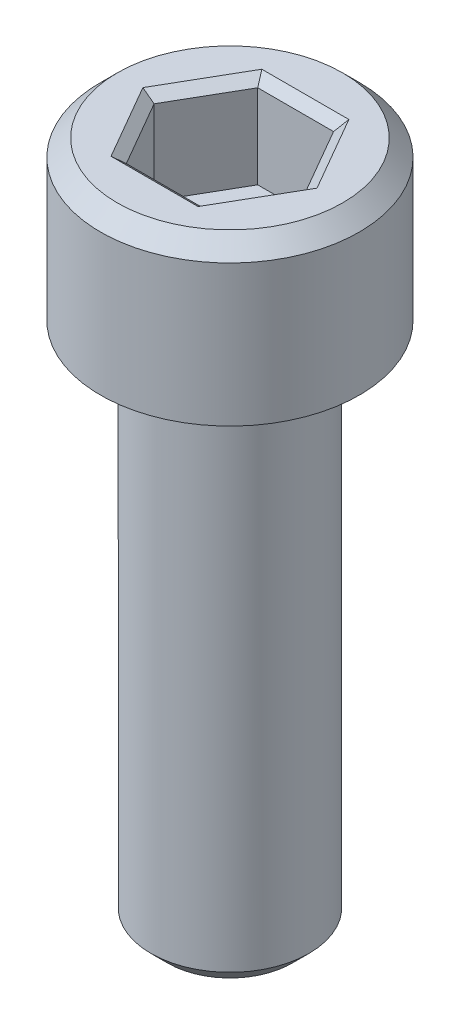
ISO-10303-21;
HEADER;
FILE_DESCRIPTION(('STEP AP214'),'2;1');
FILE_NAME('part.step','',(''),(''),'','','');
FILE_SCHEMA(('AUTOMOTIVE_DESIGN { 1 0 10303 214 1 1 1 1 }'));
ENDSEC;
DATA;
#1=APPLICATION_CONTEXT('core data for automotive mechanical design processes');
#2=APPLICATION_PROTOCOL_DEFINITION('international standard','automotive_design',2000,#1);
#3=PRODUCT_CONTEXT('',#1,'mechanical');
#4=PRODUCT('Part','Part','',(#3));
#5=PRODUCT_RELATED_PRODUCT_CATEGORY('part','',(#4));
#6=PRODUCT_DEFINITION_FORMATION('','',#4);
#7=PRODUCT_DEFINITION_CONTEXT('part definition',#1,'design');
#8=PRODUCT_DEFINITION('design','',#6,#7);
#9=PRODUCT_DEFINITION_SHAPE('','',#8);
#10=(LENGTH_UNIT() NAMED_UNIT(*) SI_UNIT(.MILLI.,.METRE.));
#11=(NAMED_UNIT(*) PLANE_ANGLE_UNIT() SI_UNIT($,.RADIAN.));
#12=(NAMED_UNIT(*) SI_UNIT($,.STERADIAN.) SOLID_ANGLE_UNIT());
#13=UNCERTAINTY_MEASURE_WITH_UNIT(LENGTH_MEASURE(1.E-05),#10,'distance_accuracy_value','');
#14=(GEOMETRIC_REPRESENTATION_CONTEXT(3) GLOBAL_UNCERTAINTY_ASSIGNED_CONTEXT((#13)) GLOBAL_UNIT_ASSIGNED_CONTEXT((#10,
#11,#12)) REPRESENTATION_CONTEXT('',''));
#15=CARTESIAN_POINT('',(0.,0.,0.));
#16=DIRECTION('',(0.,0.,1.));
#17=DIRECTION('',(1.,0.,0.));
#18=AXIS2_PLACEMENT_3D('',#15,#16,#17);
#19=CARTESIAN_POINT('',(-2.3876,0.,0.));
#20=DIRECTION('',(0.,1.,0.));
#21=DIRECTION('',(0.,0.,1.));
#22=AXIS2_PLACEMENT_3D('',#19,#20,#21);
#23=PLANE('',#22);
#24=CARTESIAN_POINT('',(0.,0.,0.));
#25=DIRECTION('',(0.,1.,0.));
#26=DIRECTION('',(0.,0.,1.));
#27=AXIS2_PLACEMENT_3D('',#24,#25,#26);
#28=CIRCLE('',#27,1.87959999999999);
#29=CARTESIAN_POINT('',(0.,0.,1.87959999999999));
#30=VERTEX_POINT('',#29);
#31=EDGE_CURVE('E165',#30,#30,#28,.F.);
#32=ORIENTED_EDGE('',*,*,#31,.T.);
#33=EDGE_LOOP('',(#32));
#34=FACE_BOUND('',#33,.T.);
#35=ADVANCED_FACE('F36',(#34),#23,.F.);
#36=CARTESIAN_POINT('',(0.,20.6502,0.));
#37=DIRECTION('',(0.,-1.,0.));
#38=DIRECTION('',(0.,0.,-1.));
#39=AXIS2_PLACEMENT_3D('',#36,#37,#38);
#40=PLANE('',#39);
#41=DIRECTION('',(0.5,0.,-0.866025403784439));
#42=VECTOR('',#41,1.);
#43=CARTESIAN_POINT('',(-1.97251955281603,20.6502,-1.13883469480014));
#44=LINE('',#43,#42);
#45=CARTESIAN_POINT('',(-2.63002607042138,20.6502,0.));
#46=VERTEX_POINT('',#45);
#47=CARTESIAN_POINT('',(-1.31501303521069,20.6502,-2.27766938960027));
#48=VERTEX_POINT('',#47);
#49=EDGE_CURVE('E176',#46,#48,#44,.T.);
#50=ORIENTED_EDGE('',*,*,#49,.T.);
#51=DIRECTION('',(1.,0.,0.));
#52=VECTOR('',#51,1.);
#53=CARTESIAN_POINT('',(0.,20.6502,-2.27766938960027));
#54=LINE('',#53,#52);
#55=CARTESIAN_POINT('',(1.31501303521069,20.6502,-2.27766938960027));
#56=VERTEX_POINT('',#55);
#57=EDGE_CURVE('E184',#48,#56,#54,.T.);
#58=ORIENTED_EDGE('',*,*,#57,.T.);
#59=DIRECTION('',(0.5,0.,0.866025403784439));
#60=VECTOR('',#59,1.);
#61=CARTESIAN_POINT('',(1.97251955281603,20.6502,-1.13883469480014));
#62=LINE('',#61,#60);
#63=CARTESIAN_POINT('',(2.63002607042138,20.6502,0.));
#64=VERTEX_POINT('',#63);
#65=EDGE_CURVE('E182',#56,#64,#62,.T.);
#66=ORIENTED_EDGE('',*,*,#65,.T.);
#67=DIRECTION('',(-0.5,0.,0.866025403784439));
#68=VECTOR('',#67,1.);
#69=CARTESIAN_POINT('',(1.97251955281603,20.6502,1.13883469480014));
#70=LINE('',#69,#68);
#71=CARTESIAN_POINT('',(1.31501303521069,20.6502,2.27766938960027));
#72=VERTEX_POINT('',#71);
#73=EDGE_CURVE('E180',#64,#72,#70,.T.);
#74=ORIENTED_EDGE('',*,*,#73,.T.);
#75=DIRECTION('',(-1.,0.,0.));
#76=VECTOR('',#75,1.);
#77=CARTESIAN_POINT('',(0.,20.6502,2.27766938960027));
#78=LINE('',#77,#76);
#79=CARTESIAN_POINT('',(-1.31501303521069,20.6502,2.27766938960027));
#80=VERTEX_POINT('',#79);
#81=EDGE_CURVE('E178',#72,#80,#78,.T.);
#82=ORIENTED_EDGE('',*,*,#81,.T.);
#83=DIRECTION('',(-0.5,0.,-0.866025403784439));
#84=VECTOR('',#83,1.);
#85=CARTESIAN_POINT('',(-1.97251955281603,20.6502,1.13883469480014));
#86=LINE('',#85,#84);
#87=EDGE_CURVE('E174',#80,#46,#86,.T.);
#88=ORIENTED_EDGE('',*,*,#87,.T.);
#89=EDGE_LOOP('',(#50,#58,#66,#74,#82,#88));
#90=FACE_BOUND('',#89,.T.);
#91=CARTESIAN_POINT('',(0.,20.6502,0.));
#92=DIRECTION('',(0.,-1.,0.));
#93=DIRECTION('',(0.,0.,-1.));
#94=AXIS2_PLACEMENT_3D('',#91,#92,#93);
#95=CIRCLE('',#94,3.4036);
#96=CARTESIAN_POINT('',(0.,20.6502,-3.4036));
#97=VERTEX_POINT('',#96);
#98=EDGE_CURVE('E162',#97,#97,#95,.F.);
#99=ORIENTED_EDGE('',*,*,#98,.T.);
#100=EDGE_LOOP('',(#99));
#101=FACE_BOUND('',#100,.T.);
#102=ADVANCED_FACE('F231',(#90,#101),#40,.F.);
#103=CARTESIAN_POINT('',(0.,0.,0.));
#104=DIRECTION('',(0.,-1.,0.));
#105=DIRECTION('',(0.,0.,-1.));
#106=AXIS2_PLACEMENT_3D('',#103,#104,#105);
#107=CYLINDRICAL_SURFACE('',#106,3.9116);
#108=CARTESIAN_POINT('',(0.,20.1422,0.));
#109=DIRECTION('',(0.,-1.,0.));
#110=DIRECTION('',(0.,0.,-1.));
#111=AXIS2_PLACEMENT_3D('',#108,#109,#110);
#112=CIRCLE('',#111,3.9116);
#113=CARTESIAN_POINT('',(0.,20.1422,-3.9116));
#114=VERTEX_POINT('',#113);
#115=EDGE_CURVE('E159',#114,#114,#112,.T.);
#116=ORIENTED_EDGE('',*,*,#115,.T.);
#117=EDGE_LOOP('',(#116));
#118=FACE_BOUND('',#117,.T.);
#119=CARTESIAN_POINT('',(0.,15.875,0.));
#120=DIRECTION('',(0.,-1.,0.));
#121=DIRECTION('',(0.,0.,-1.));
#122=AXIS2_PLACEMENT_3D('',#119,#120,#121);
#123=CIRCLE('',#122,3.9116);
#124=CARTESIAN_POINT('',(0.,15.875,-3.9116));
#125=VERTEX_POINT('',#124);
#126=EDGE_CURVE('E156',#125,#125,#123,.T.);
#127=ORIENTED_EDGE('',*,*,#126,.F.);
#128=EDGE_LOOP('',(#127));
#129=FACE_BOUND('',#128,.T.);
#130=ADVANCED_FACE('F253',(#118,#129),#107,.T.);
#131=CARTESIAN_POINT('',(-3.9116,15.875,0.));
#132=DIRECTION('',(0.,1.,0.));
#133=DIRECTION('',(0.,0.,1.));
#134=AXIS2_PLACEMENT_3D('',#131,#132,#133);
#135=PLANE('',#134);
#136=CARTESIAN_POINT('',(0.,15.875,0.));
#137=DIRECTION('',(0.,-1.,0.));
#138=DIRECTION('',(0.,0.,-1.));
#139=AXIS2_PLACEMENT_3D('',#136,#137,#138);
#140=CIRCLE('',#139,2.3876);
#141=CARTESIAN_POINT('',(0.,15.875,-2.3876));
#142=VERTEX_POINT('',#141);
#143=EDGE_CURVE('E146',#142,#142,#140,.T.);
#144=ORIENTED_EDGE('',*,*,#143,.F.);
#145=EDGE_LOOP('',(#144));
#146=FACE_BOUND('',#145,.T.);
#147=ORIENTED_EDGE('',*,*,#126,.T.);
#148=EDGE_LOOP('',(#147));
#149=FACE_BOUND('',#148,.T.);
#150=ADVANCED_FACE('F377',(#146,#149),#135,.F.);
#151=CARTESIAN_POINT('',(0.,0.,0.));
#152=DIRECTION('',(0.,-1.,0.));
#153=DIRECTION('',(0.,0.,-1.));
#154=AXIS2_PLACEMENT_3D('',#151,#152,#153);
#155=CYLINDRICAL_SURFACE('',#154,2.3876);
#156=CARTESIAN_POINT('',(0.,0.508000000000008,0.));
#157=DIRECTION('',(0.,1.,0.));
#158=DIRECTION('',(0.,0.,1.));
#159=AXIS2_PLACEMENT_3D('',#156,#157,#158);
#160=CIRCLE('',#159,2.3876);
#161=CARTESIAN_POINT('',(0.,0.508000000000008,2.3876));
#162=VERTEX_POINT('',#161);
#163=EDGE_CURVE('E168',#162,#162,#160,.T.);
#164=ORIENTED_EDGE('',*,*,#163,.T.);
#165=EDGE_LOOP('',(#164));
#166=FACE_BOUND('',#165,.T.);
#167=ORIENTED_EDGE('',*,*,#143,.T.);
#168=EDGE_LOOP('',(#167));
#169=FACE_BOUND('',#168,.T.);
#170=ADVANCED_FACE('F348',(#166,#169),#155,.T.);
#171=CARTESIAN_POINT('',(1.1456797,17.8562,1.98437544960027));
#172=DIRECTION('',(0.866025403784439,0.,0.5));
#173=DIRECTION('',(0.5,0.,-0.866025403784439));
#174=AXIS2_PLACEMENT_3D('',#171,#172,#173);
#175=PLANE('',#174);
#176=DIRECTION('',(0.,1.,0.));
#177=VECTOR('',#176,1.);
#178=CARTESIAN_POINT('',(1.1456797,17.8562,1.98437544960027));
#179=LINE('',#178,#177);
#180=CARTESIAN_POINT('',(1.1456797,17.8562,1.98437544960027));
#181=VERTEX_POINT('',#180);
#182=CARTESIAN_POINT('',(1.1456797,20.3962000388316,1.98437544960027));
#183=VERTEX_POINT('',#182);
#184=EDGE_CURVE('E144',#181,#183,#179,.T.);
#185=ORIENTED_EDGE('',*,*,#184,.T.);
#186=DIRECTION('',(0.5,0.,-0.866025403784439));
#187=VECTOR('',#186,1.);
#188=CARTESIAN_POINT('',(1.1456797,20.3962000388316,1.98437544960027));
#189=LINE('',#188,#187);
#190=CARTESIAN_POINT('',(2.2913594,20.3962000388316,0.));
#191=VERTEX_POINT('',#190);
#192=EDGE_CURVE('E115',#183,#191,#189,.T.);
#193=ORIENTED_EDGE('',*,*,#192,.T.);
#194=DIRECTION('',(0.,1.,0.));
#195=VECTOR('',#194,1.);
#196=CARTESIAN_POINT('',(2.2913594,17.8562,0.));
#197=LINE('',#196,#195);
#198=CARTESIAN_POINT('',(2.2913594,17.8562,0.));
#199=VERTEX_POINT('',#198);
#200=EDGE_CURVE('E107',#199,#191,#197,.T.);
#201=ORIENTED_EDGE('',*,*,#200,.F.);
#202=DIRECTION('',(0.5,0.,-0.866025403784439));
#203=VECTOR('',#202,1.);
#204=CARTESIAN_POINT('',(1.1456797,17.8562,1.98437544960027));
#205=LINE('',#204,#203);
#206=EDGE_CURVE('E112',#181,#199,#205,.T.);
#207=ORIENTED_EDGE('',*,*,#206,.F.);
#208=EDGE_LOOP('',(#185,#193,#201,#207));
#209=FACE_BOUND('',#208,.T.);
#210=ADVANCED_FACE('F110',(#209),#175,.F.);
#211=CARTESIAN_POINT('',(-1.1456797,17.8562,1.98437544960027));
#212=DIRECTION('',(0.,0.,1.));
#213=DIRECTION('',(1.,0.,0.));
#214=AXIS2_PLACEMENT_3D('',#211,#212,#213);
#215=PLANE('',#214);
#216=DIRECTION('',(0.,1.,0.));
#217=VECTOR('',#216,1.);
#218=CARTESIAN_POINT('',(-1.1456797,17.8562,1.98437544960027));
#219=LINE('',#218,#217);
#220=CARTESIAN_POINT('',(-1.1456797,17.8562,1.98437544960027));
#221=VERTEX_POINT('',#220);
#222=CARTESIAN_POINT('',(-1.1456797,20.3962000388316,1.98437544960027));
#223=VERTEX_POINT('',#222);
#224=EDGE_CURVE('E147',#221,#223,#219,.T.);
#225=ORIENTED_EDGE('',*,*,#224,.T.);
#226=DIRECTION('',(1.,0.,0.));
#227=VECTOR('',#226,1.);
#228=CARTESIAN_POINT('',(-1.1456797,20.3962000388316,1.98437544960027));
#229=LINE('',#228,#227);
#230=EDGE_CURVE('E190',#223,#183,#229,.T.);
#231=ORIENTED_EDGE('',*,*,#230,.T.);
#232=ORIENTED_EDGE('',*,*,#184,.F.);
#233=DIRECTION('',(1.,0.,0.));
#234=VECTOR('',#233,1.);
#235=CARTESIAN_POINT('',(-1.1456797,17.8562,1.98437544960027));
#236=LINE('',#235,#234);
#237=EDGE_CURVE('E119',#221,#181,#236,.T.);
#238=ORIENTED_EDGE('',*,*,#237,.F.);
#239=EDGE_LOOP('',(#225,#231,#232,#238));
#240=FACE_BOUND('',#239,.T.);
#241=ADVANCED_FACE('F213',(#240),#215,.F.);
#242=CARTESIAN_POINT('',(-2.2913594,17.8562,0.));
#243=DIRECTION('',(-0.866025403784439,0.,0.5));
#244=DIRECTION('',(0.5,0.,0.866025403784439));
#245=AXIS2_PLACEMENT_3D('',#242,#243,#244);
#246=PLANE('',#245);
#247=DIRECTION('',(0.,1.,0.));
#248=VECTOR('',#247,1.);
#249=CARTESIAN_POINT('',(-2.2913594,17.8562,0.));
#250=LINE('',#249,#248);
#251=CARTESIAN_POINT('',(-2.2913594,17.8562,0.));
#252=VERTEX_POINT('',#251);
#253=CARTESIAN_POINT('',(-2.2913594,20.3962000388316,0.));
#254=VERTEX_POINT('',#253);
#255=EDGE_CURVE('E149',#252,#254,#250,.T.);
#256=ORIENTED_EDGE('',*,*,#255,.T.);
#257=DIRECTION('',(0.5,0.,0.866025403784439));
#258=VECTOR('',#257,1.);
#259=CARTESIAN_POINT('',(-2.2913594,20.3962000388316,0.));
#260=LINE('',#259,#258);
#261=EDGE_CURVE('E11',#254,#223,#260,.T.);
#262=ORIENTED_EDGE('',*,*,#261,.T.);
#263=ORIENTED_EDGE('',*,*,#224,.F.);
#264=DIRECTION('',(0.5,0.,0.866025403784439));
#265=VECTOR('',#264,1.);
#266=CARTESIAN_POINT('',(-2.2913594,17.8562,0.));
#267=LINE('',#266,#265);
#268=EDGE_CURVE('E141',#252,#221,#267,.T.);
#269=ORIENTED_EDGE('',*,*,#268,.F.);
#270=EDGE_LOOP('',(#256,#262,#263,#269));
#271=FACE_BOUND('',#270,.T.);
#272=ADVANCED_FACE('F215',(#271),#246,.F.);
#273=CARTESIAN_POINT('',(-1.1456797,17.8562,-1.98437544960027));
#274=DIRECTION('',(-0.866025403784439,0.,-0.5));
#275=DIRECTION('',(-0.5,0.,0.866025403784439));
#276=AXIS2_PLACEMENT_3D('',#273,#274,#275);
#277=PLANE('',#276);
#278=DIRECTION('',(0.,1.,0.));
#279=VECTOR('',#278,1.);
#280=CARTESIAN_POINT('',(-1.1456797,17.8562,-1.98437544960027));
#281=LINE('',#280,#279);
#282=CARTESIAN_POINT('',(-1.1456797,17.8562,-1.98437544960027));
#283=VERTEX_POINT('',#282);
#284=CARTESIAN_POINT('',(-1.1456797,20.3962000388316,-1.98437544960027));
#285=VERTEX_POINT('',#284);
#286=EDGE_CURVE('E151',#283,#285,#281,.T.);
#287=ORIENTED_EDGE('',*,*,#286,.T.);
#288=DIRECTION('',(-0.5,0.,0.866025403784439));
#289=VECTOR('',#288,1.);
#290=CARTESIAN_POINT('',(-1.1456797,20.3962000388316,-1.98437544960027));
#291=LINE('',#290,#289);
#292=EDGE_CURVE('E45',#285,#254,#291,.T.);
#293=ORIENTED_EDGE('',*,*,#292,.T.);
#294=ORIENTED_EDGE('',*,*,#255,.F.);
#295=DIRECTION('',(-0.5,0.,0.866025403784439));
#296=VECTOR('',#295,1.);
#297=CARTESIAN_POINT('',(-1.1456797,17.8562,-1.98437544960027));
#298=LINE('',#297,#296);
#299=EDGE_CURVE('E138',#283,#252,#298,.T.);
#300=ORIENTED_EDGE('',*,*,#299,.F.);
#301=EDGE_LOOP('',(#287,#293,#294,#300));
#302=FACE_BOUND('',#301,.T.);
#303=ADVANCED_FACE('F217',(#302),#277,.F.);
#304=CARTESIAN_POINT('',(1.1456797,17.8562,-1.98437544960027));
#305=DIRECTION('',(0.,0.,-1.));
#306=DIRECTION('',(-1.,0.,0.));
#307=AXIS2_PLACEMENT_3D('',#304,#305,#306);
#308=PLANE('',#307);
#309=DIRECTION('',(0.,1.,0.));
#310=VECTOR('',#309,1.);
#311=CARTESIAN_POINT('',(1.1456797,17.8562,-1.98437544960027));
#312=LINE('',#311,#310);
#313=CARTESIAN_POINT('',(1.1456797,17.8562,-1.98437544960027));
#314=VERTEX_POINT('',#313);
#315=CARTESIAN_POINT('',(1.1456797,20.3962000388316,-1.98437544960027));
#316=VERTEX_POINT('',#315);
#317=EDGE_CURVE('E118',#314,#316,#312,.T.);
#318=ORIENTED_EDGE('',*,*,#317,.T.);
#319=DIRECTION('',(-1.,0.,0.));
#320=VECTOR('',#319,1.);
#321=CARTESIAN_POINT('',(1.1456797,20.3962000388316,-1.98437544960027));
#322=LINE('',#321,#320);
#323=EDGE_CURVE('E171',#316,#285,#322,.T.);
#324=ORIENTED_EDGE('',*,*,#323,.T.);
#325=ORIENTED_EDGE('',*,*,#286,.F.);
#326=DIRECTION('',(-1.,0.,0.));
#327=VECTOR('',#326,1.);
#328=CARTESIAN_POINT('',(1.1456797,17.8562,-1.98437544960027));
#329=LINE('',#328,#327);
#330=EDGE_CURVE('E128',#314,#283,#329,.T.);
#331=ORIENTED_EDGE('',*,*,#330,.F.);
#332=EDGE_LOOP('',(#318,#324,#325,#331));
#333=FACE_BOUND('',#332,.T.);
#334=ADVANCED_FACE('F219',(#333),#308,.F.);
#335=CARTESIAN_POINT('',(2.2913594,17.8562,0.));
#336=DIRECTION('',(0.866025403784438,0.,-0.5));
#337=DIRECTION('',(-0.5,0.,-0.866025403784438));
#338=AXIS2_PLACEMENT_3D('',#335,#336,#337);
#339=PLANE('',#338);
#340=ORIENTED_EDGE('',*,*,#200,.T.);
#341=DIRECTION('',(-0.5,0.,-0.866025403784438));
#342=VECTOR('',#341,1.);
#343=CARTESIAN_POINT('',(2.2913594,20.3962000388316,0.));
#344=LINE('',#343,#342);
#345=EDGE_CURVE('E187',#191,#316,#344,.T.);
#346=ORIENTED_EDGE('',*,*,#345,.T.);
#347=ORIENTED_EDGE('',*,*,#317,.F.);
#348=DIRECTION('',(-0.5,0.,-0.866025403784438));
#349=VECTOR('',#348,1.);
#350=CARTESIAN_POINT('',(2.2913594,17.8562,0.));
#351=LINE('',#350,#349);
#352=EDGE_CURVE('E122',#199,#314,#351,.T.);
#353=ORIENTED_EDGE('',*,*,#352,.F.);
#354=EDGE_LOOP('',(#340,#346,#347,#353));
#355=FACE_BOUND('',#354,.T.);
#356=ADVANCED_FACE('F123',(#355),#339,.F.);
#357=CARTESIAN_POINT('',(2.2913594,17.8562,0.));
#358=DIRECTION('',(0.,1.,0.));
#359=DIRECTION('',(0.,0.,1.));
#360=AXIS2_PLACEMENT_3D('',#357,#358,#359);
#361=PLANE('',#360);
#362=ORIENTED_EDGE('',*,*,#206,.T.);
#363=ORIENTED_EDGE('',*,*,#352,.T.);
#364=ORIENTED_EDGE('',*,*,#330,.T.);
#365=ORIENTED_EDGE('',*,*,#299,.T.);
#366=ORIENTED_EDGE('',*,*,#268,.T.);
#367=ORIENTED_EDGE('',*,*,#237,.T.);
#368=EDGE_LOOP('',(#362,#363,#364,#365,#366,#367));
#369=FACE_BOUND('',#368,.T.);
#370=ADVANCED_FACE('F130',(#369),#361,.T.);
#371=CARTESIAN_POINT('',(0.,20.1422,0.));
#372=DIRECTION('',(0.,-1.,0.));
#373=DIRECTION('',(0.,0.,-1.));
#374=AXIS2_PLACEMENT_3D('',#371,#372,#373);
#375=CONICAL_SURFACE('',#374,3.9116,0.785398163397452);
#376=ORIENTED_EDGE('',*,*,#98,.F.);
#377=EDGE_LOOP('',(#376));
#378=FACE_BOUND('',#377,.T.);
#379=ORIENTED_EDGE('',*,*,#115,.F.);
#380=EDGE_LOOP('',(#379));
#381=FACE_BOUND('',#380,.T.);
#382=ADVANCED_FACE('F257',(#378,#381),#375,.T.);
#383=CARTESIAN_POINT('',(0.,0.,0.));
#384=DIRECTION('',(0.,1.,0.));
#385=DIRECTION('',(0.,0.,1.));
#386=AXIS2_PLACEMENT_3D('',#383,#384,#385);
#387=CONICAL_SURFACE('',#386,1.87959999999999,0.785398163397447);
#388=ORIENTED_EDGE('',*,*,#163,.F.);
#389=EDGE_LOOP('',(#388));
#390=FACE_BOUND('',#389,.T.);
#391=ORIENTED_EDGE('',*,*,#31,.F.);
#392=EDGE_LOOP('',(#391));
#393=FACE_BOUND('',#392,.T.);
#394=ADVANCED_FACE('F260',(#390,#393),#387,.T.);
#395=CARTESIAN_POINT('',(-1.1456797,20.3962000388316,1.98437544960027));
#396=DIRECTION('',(0.,-0.755928999138779,0.654653609369905));
#397=DIRECTION('',(0.,-0.654653609369905,-0.755928999138779));
#398=AXIS2_PLACEMENT_3D('',#395,#396,#397);
#399=PLANE('',#398);
#400=DIRECTION('',(0.400000023611253,-0.599999937036657,-0.692820363923438));
#401=VECTOR('',#400,1.);
#402=CARTESIAN_POINT('',(-1.1456797,20.3962000388316,1.98437544960027));
#403=LINE('',#402,#401);
#404=EDGE_CURVE('E135',#80,#223,#403,.T.);
#405=ORIENTED_EDGE('',*,*,#404,.F.);
#406=ORIENTED_EDGE('',*,*,#81,.F.);
#407=DIRECTION('',(-0.400000023611252,-0.599999937036657,-0.692820363923438));
#408=VECTOR('',#407,1.);
#409=CARTESIAN_POINT('',(1.1456797,20.3962000388316,1.98437544960027));
#410=LINE('',#409,#408);
#411=EDGE_CURVE('E40',#183,#72,#410,.F.);
#412=ORIENTED_EDGE('',*,*,#411,.F.);
#413=ORIENTED_EDGE('',*,*,#230,.F.);
#414=EDGE_LOOP('',(#405,#406,#412,#413));
#415=FACE_BOUND('',#414,.T.);
#416=ADVANCED_FACE('F38',(#415),#399,.F.);
#417=CARTESIAN_POINT('',(1.1456797,20.3962000388316,1.98437544960027));
#418=DIRECTION('',(0.566946656393512,-0.755928999138779,0.327326804684952));
#419=DIRECTION('',(0.800000047222504,0.599999937036657,0.));
#420=AXIS2_PLACEMENT_3D('',#417,#418,#419);
#421=PLANE('',#420);
#422=ORIENTED_EDGE('',*,*,#411,.T.);
#423=ORIENTED_EDGE('',*,*,#73,.F.);
#424=DIRECTION('',(-0.800000047222504,-0.599999937036657,0.));
#425=VECTOR('',#424,1.);
#426=CARTESIAN_POINT('',(2.2913594,20.3962000388316,0.));
#427=LINE('',#426,#425);
#428=EDGE_CURVE('E200',#191,#64,#427,.F.);
#429=ORIENTED_EDGE('',*,*,#428,.F.);
#430=ORIENTED_EDGE('',*,*,#192,.F.);
#431=EDGE_LOOP('',(#422,#423,#429,#430));
#432=FACE_BOUND('',#431,.T.);
#433=ADVANCED_FACE('F235',(#432),#421,.F.);
#434=CARTESIAN_POINT('',(-2.2913594,20.3962000388316,0.));
#435=DIRECTION('',(-0.566946656393512,-0.755928999138779,0.327326804684952));
#436=DIRECTION('',(0.800000047222504,-0.599999937036656,0.));
#437=AXIS2_PLACEMENT_3D('',#434,#435,#436);
#438=PLANE('',#437);
#439=ORIENTED_EDGE('',*,*,#404,.T.);
#440=ORIENTED_EDGE('',*,*,#261,.F.);
#441=DIRECTION('',(-0.800000047222504,0.599999937036657,0.));
#442=VECTOR('',#441,1.);
#443=CARTESIAN_POINT('',(-1.55812430543701,19.8462738080791,0.));
#444=LINE('',#443,#442);
#445=EDGE_CURVE('E197',#46,#254,#444,.F.);
#446=ORIENTED_EDGE('',*,*,#445,.F.);
#447=ORIENTED_EDGE('',*,*,#87,.F.);
#448=EDGE_LOOP('',(#439,#440,#446,#447));
#449=FACE_BOUND('',#448,.T.);
#450=ADVANCED_FACE('F206',(#449),#438,.F.);
#451=CARTESIAN_POINT('',(2.2913594,20.3962000388316,0.));
#452=DIRECTION('',(0.566946656393512,-0.755928999138779,-0.327326804684953));
#453=DIRECTION('',(0.800000047222504,0.599999937036656,0.));
#454=AXIS2_PLACEMENT_3D('',#451,#452,#453);
#455=PLANE('',#454);
#456=ORIENTED_EDGE('',*,*,#428,.T.);
#457=ORIENTED_EDGE('',*,*,#65,.F.);
#458=DIRECTION('',(-0.400000023611252,-0.599999937036657,0.692820363923438));
#459=VECTOR('',#458,1.);
#460=CARTESIAN_POINT('',(1.1456797,20.3962000388316,-1.98437544960027));
#461=LINE('',#460,#459);
#462=EDGE_CURVE('E195',#316,#56,#461,.F.);
#463=ORIENTED_EDGE('',*,*,#462,.F.);
#464=ORIENTED_EDGE('',*,*,#345,.F.);
#465=EDGE_LOOP('',(#456,#457,#463,#464));
#466=FACE_BOUND('',#465,.T.);
#467=ADVANCED_FACE('F238',(#466),#455,.F.);
#468=CARTESIAN_POINT('',(-1.1456797,20.3962000388316,-1.98437544960027));
#469=DIRECTION('',(-0.566946656393512,-0.755928999138779,-0.327326804684952));
#470=DIRECTION('',(0.800000047222503,-0.599999937036657,0.));
#471=AXIS2_PLACEMENT_3D('',#468,#469,#470);
#472=PLANE('',#471);
#473=ORIENTED_EDGE('',*,*,#445,.T.);
#474=ORIENTED_EDGE('',*,*,#292,.F.);
#475=DIRECTION('',(-0.400000023611252,0.599999937036657,-0.692820363923438));
#476=VECTOR('',#475,1.);
#477=CARTESIAN_POINT('',(-0.779062152718508,19.8462738080791,-1.34937523076244));
#478=LINE('',#477,#476);
#479=EDGE_CURVE('E193',#48,#285,#478,.F.);
#480=ORIENTED_EDGE('',*,*,#479,.F.);
#481=ORIENTED_EDGE('',*,*,#49,.F.);
#482=EDGE_LOOP('',(#473,#474,#480,#481));
#483=FACE_BOUND('',#482,.T.);
#484=ADVANCED_FACE('F229',(#483),#472,.F.);
#485=CARTESIAN_POINT('',(1.1456797,20.3962000388316,-1.98437544960027));
#486=DIRECTION('',(0.,-0.755928999138779,-0.654653609369905));
#487=DIRECTION('',(0.,0.654653609369905,-0.755928999138779));
#488=AXIS2_PLACEMENT_3D('',#485,#486,#487);
#489=PLANE('',#488);
#490=ORIENTED_EDGE('',*,*,#462,.T.);
#491=ORIENTED_EDGE('',*,*,#57,.F.);
#492=ORIENTED_EDGE('',*,*,#479,.T.);
#493=ORIENTED_EDGE('',*,*,#323,.F.);
#494=EDGE_LOOP('',(#490,#491,#492,#493));
#495=FACE_BOUND('',#494,.T.);
#496=ADVANCED_FACE('F223',(#495),#489,.F.);
#497=CLOSED_SHELL('',(#35,#102,#130,#150,#170,#210,#241,#272,#303,#334,#356,#370,#382,#394,#416,
#433,#450,#467,#484,#496));
#498=MANIFOLD_SOLID_BREP('B2',#497);
#499=ADVANCED_BREP_SHAPE_REPRESENTATION('',(#18,#498),#14);
#500=SHAPE_DEFINITION_REPRESENTATION(#9,#499);
ENDSEC;
END-ISO-10303-21;
